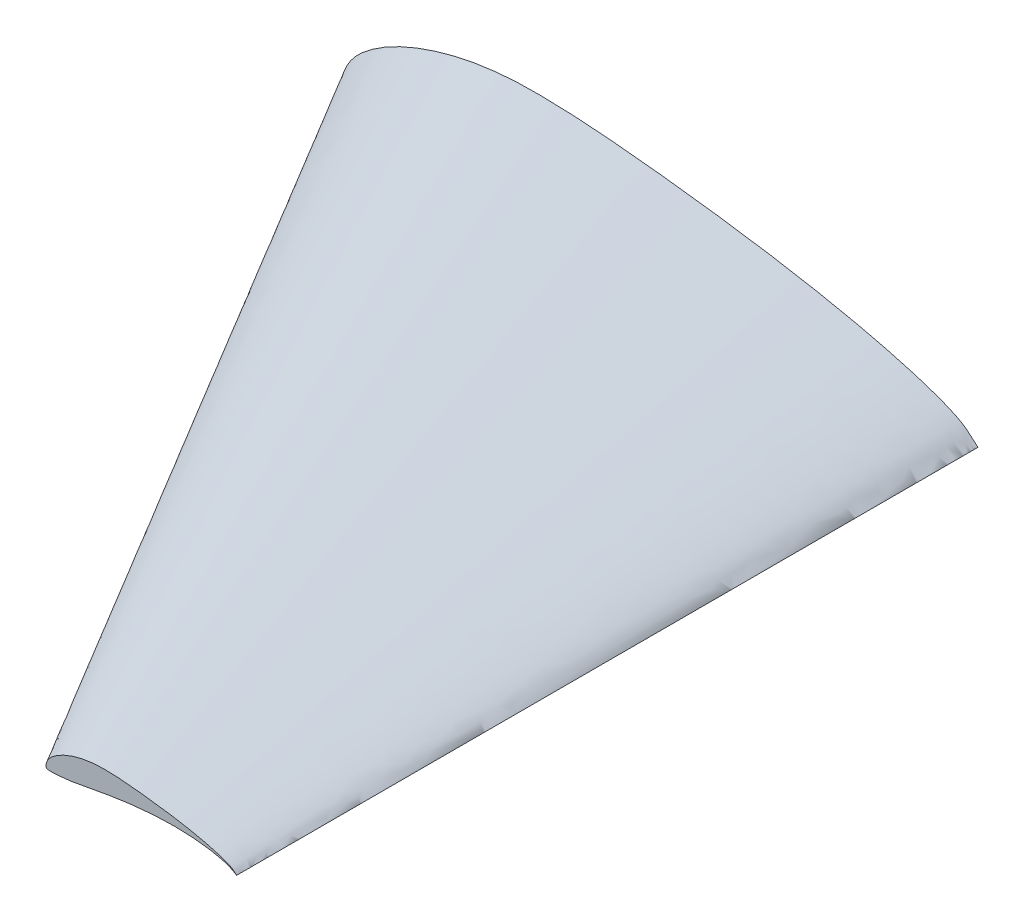
ISO-10303-21;
HEADER;
FILE_DESCRIPTION(('STEP AP214'),'2;1');
FILE_NAME('part.step','',(''),(''),'','','');
FILE_SCHEMA(('AUTOMOTIVE_DESIGN { 1 0 10303 214 1 1 1 1 }'));
ENDSEC;
DATA;
#1=APPLICATION_CONTEXT('core data for automotive mechanical design processes');
#2=APPLICATION_PROTOCOL_DEFINITION('international standard','automotive_design',2000,#1);
#3=PRODUCT_CONTEXT('',#1,'mechanical');
#4=PRODUCT('Part','Part','',(#3));
#5=PRODUCT_RELATED_PRODUCT_CATEGORY('part','',(#4));
#6=PRODUCT_DEFINITION_FORMATION('','',#4);
#7=PRODUCT_DEFINITION_CONTEXT('part definition',#1,'design');
#8=PRODUCT_DEFINITION('design','',#6,#7);
#9=PRODUCT_DEFINITION_SHAPE('','',#8);
#10=(LENGTH_UNIT() NAMED_UNIT(*) SI_UNIT(.MILLI.,.METRE.));
#11=(NAMED_UNIT(*) PLANE_ANGLE_UNIT() SI_UNIT($,.RADIAN.));
#12=(NAMED_UNIT(*) SI_UNIT($,.STERADIAN.) SOLID_ANGLE_UNIT());
#13=UNCERTAINTY_MEASURE_WITH_UNIT(LENGTH_MEASURE(1.E-05),#10,'distance_accuracy_value','');
#14=(GEOMETRIC_REPRESENTATION_CONTEXT(3) GLOBAL_UNCERTAINTY_ASSIGNED_CONTEXT((#13)) GLOBAL_UNIT_ASSIGNED_CONTEXT((#10,
#11,#12)) REPRESENTATION_CONTEXT('',''));
#15=CARTESIAN_POINT('',(0.,0.,0.));
#16=DIRECTION('',(0.,0.,1.));
#17=DIRECTION('',(1.,0.,0.));
#18=AXIS2_PLACEMENT_3D('',#15,#16,#17);
#19=CARTESIAN_POINT('',(0.358648893938825,1.31203835702179,0.));
#20=DIRECTION('',(0.,0.,-1.));
#21=DIRECTION('',(-1.,0.,0.));
#22=AXIS2_PLACEMENT_3D('',#19,#20,#21);
#23=PLANE('',#22);
#24=CARTESIAN_POINT('',(40.02,5.,0.));
#25=DIRECTION('',(0.,0.,-1.));
#26=DIRECTION('',(-1.,0.,0.));
#27=AXIS2_PLACEMENT_3D('',#24,#25,#26);
#28=CIRCLE('',#27,0.750000000000008);
#29=CARTESIAN_POINT('',(40.02,5.75000000000001,0.));
#30=VERTEX_POINT('',#29);
#31=CARTESIAN_POINT('',(40.02,4.24999999999999,0.));
#32=VERTEX_POINT('',#31);
#33=EDGE_CURVE('E86',#30,#32,#28,.T.);
#34=ORIENTED_EDGE('',*,*,#33,.F.);
#35=DIRECTION('',(-1.,0.,0.));
#36=VECTOR('',#35,1.);
#37=CARTESIAN_POINT('',(40.02,5.75000000000001,0.));
#38=LINE('',#37,#36);
#39=CARTESIAN_POINT('',(27.02,5.75,0.));
#40=VERTEX_POINT('',#39);
#41=EDGE_CURVE('E167',#30,#40,#38,.T.);
#42=ORIENTED_EDGE('',*,*,#41,.T.);
#43=CARTESIAN_POINT('',(27.02,5.,0.));
#44=DIRECTION('',(0.,0.,-1.));
#45=DIRECTION('',(-1.,0.,0.));
#46=AXIS2_PLACEMENT_3D('',#43,#44,#45);
#47=CIRCLE('',#46,0.749999999999999);
#48=CARTESIAN_POINT('',(27.02,4.25,0.));
#49=VERTEX_POINT('',#48);
#50=EDGE_CURVE('E180',#49,#40,#47,.T.);
#51=ORIENTED_EDGE('',*,*,#50,.F.);
#52=DIRECTION('',(-1.,0.,0.));
#53=VECTOR('',#52,1.);
#54=CARTESIAN_POINT('',(40.02,4.24999999999999,0.));
#55=LINE('',#54,#53);
#56=EDGE_CURVE('E177',#32,#49,#55,.T.);
#57=ORIENTED_EDGE('',*,*,#56,.F.);
#58=EDGE_LOOP('',(#34,#42,#51,#57));
#59=FACE_BOUND('',#58,.T.);
#60=CARTESIAN_POINT('',(23.51,5.,0.));
#61=DIRECTION('',(0.,0.,-1.));
#62=DIRECTION('',(-1.,0.,0.));
#63=AXIS2_PLACEMENT_3D('',#60,#61,#62);
#64=CIRCLE('',#63,2.);
#65=CARTESIAN_POINT('',(21.51,5.,0.));
#66=VERTEX_POINT('',#65);
#67=EDGE_CURVE('E187',#66,#66,#64,.T.);
#68=ORIENTED_EDGE('',*,*,#67,.F.);
#69=EDGE_LOOP('',(#68));
#70=FACE_BOUND('',#69,.T.);
#71=CARTESIAN_POINT('',(60.,0.,0.));
#72=CARTESIAN_POINT('',(60.0003591967076,0.00152743166866113,0.));
#73=CARTESIAN_POINT('',(59.8031171503171,0.148486190866981,0.));
#74=CARTESIAN_POINT('',(59.6363051275394,0.312157693204799,0.));
#75=CARTESIAN_POINT('',(59.265915035483,0.654017791026096,0.));
#76=CARTESIAN_POINT('',(58.828941407944,1.01769187040323,0.));
#77=CARTESIAN_POINT('',(58.2311986071286,1.38431433802317,0.));
#78=CARTESIAN_POINT('',(57.4879028587413,1.73962008144949,0.));
#79=CARTESIAN_POINT('',(56.5905605509476,2.11038996867272,0.));
#80=CARTESIAN_POINT('',(55.5405906841004,2.49165505155028,0.));
#81=CARTESIAN_POINT('',(54.3426606505066,2.87984653664435,0.));
#82=CARTESIAN_POINT('',(53.0044503542957,3.27530791932623,0.));
#83=CARTESIAN_POINT('',(51.5282398733248,3.65993308110928,0.));
#84=CARTESIAN_POINT('',(49.9318628263046,4.06561454332629,0.));
#85=CARTESIAN_POINT('',(48.2145350695117,4.45252726033602,0.));
#86=CARTESIAN_POINT('',(46.3922162813386,4.8372114388325,0.));
#87=CARTESIAN_POINT('',(44.4741846373565,5.21215240354569,0.));
#88=CARTESIAN_POINT('',(42.4720640696188,5.57436949248205,0.));
#89=CARTESIAN_POINT('',(40.3983436281798,5.92287598001367,0.));
#90=CARTESIAN_POINT('',(38.2650079778576,6.25331693697473,0.));
#91=CARTESIAN_POINT('',(36.0858440170008,6.56630027476171,0.));
#92=CARTESIAN_POINT('',(33.8748202071201,6.85935611065016,0.));
#93=CARTESIAN_POINT('',(31.6479502828675,7.13154383170439,0.));
#94=CARTESIAN_POINT('',(29.4230365764783,7.38479145195094,0.));
#95=CARTESIAN_POINT('',(27.2184980068069,7.61270867154978,0.));
#96=CARTESIAN_POINT('',(25.052294626095,7.81102981614016,0.));
#97=CARTESIAN_POINT('',(22.9396617347882,7.96859227406435,0.));
#98=CARTESIAN_POINT('',(20.8926674686435,8.07697502334032,0.));
#99=CARTESIAN_POINT('',(18.9226999256131,8.12377974427893,0.));
#100=CARTESIAN_POINT('',(17.0398509693804,8.11879768752978,0.));
#101=CARTESIAN_POINT('',(15.2476328415943,8.02660789751006,0.));
#102=CARTESIAN_POINT('',(13.5453512859509,7.839789441016,0.));
#103=CARTESIAN_POINT('',(11.926076695069,7.57562537309296,0.));
#104=CARTESIAN_POINT('',(10.3894182556015,7.23340315512576,0.));
#105=CARTESIAN_POINT('',(8.93695465998708,6.83209986705336,0.));
#106=CARTESIAN_POINT('',(7.57483146116029,6.37882320453374,0.));
#107=CARTESIAN_POINT('',(6.30884164347269,5.88417305863267,0.));
#108=CARTESIAN_POINT('',(5.14685221592727,5.35079958311253,0.));
#109=CARTESIAN_POINT('',(4.09258962341009,4.78953179393415,0.));
#110=CARTESIAN_POINT('',(3.15178940082182,4.20675239007223,0.));
#111=CARTESIAN_POINT('',(2.33035140361199,3.61035853790743,0.));
#112=CARTESIAN_POINT('',(1.62861455630535,3.01299152689761,0.));
#113=CARTESIAN_POINT('',(1.05675527613261,2.40813064719845,0.));
#114=CARTESIAN_POINT('',(0.617494407148315,1.80101400701995,0.));
#115=CARTESIAN_POINT('',(0.2930234664486,1.21037036917539,0.));
#116=CARTESIAN_POINT('',(0.0850719316488285,0.649582218808172,0.));
#117=CARTESIAN_POINT('',(-0.0140169847637187,0.131974925650224,0.));
#118=CARTESIAN_POINT('',(0.0051098577528765,-0.305798157678561,0.));
#119=CARTESIAN_POINT('',(0.117816244960925,-0.707306615975616,0.));
#120=CARTESIAN_POINT('',(0.536763933386814,-0.90661835605631,0.));
#121=CARTESIAN_POINT('',(1.10004460153965,-0.934581165480218,0.));
#122=CARTESIAN_POINT('',(1.8706104555078,-0.961682830343907,0.));
#123=CARTESIAN_POINT('',(2.8396514000118,-0.919895750020732,0.));
#124=CARTESIAN_POINT('',(3.99621535818404,-0.843103830870702,0.));
#125=CARTESIAN_POINT('',(5.3274309804443,-0.720099828376295,0.));
#126=CARTESIAN_POINT('',(6.81967624191513,-0.553670124333049,0.));
#127=CARTESIAN_POINT('',(8.46567456259763,-0.340243437522128,0.));
#128=CARTESIAN_POINT('',(10.2646215673956,-0.0419478858174395,0.));
#129=CARTESIAN_POINT('',(12.2252761749415,0.332109900745339,0.));
#130=CARTESIAN_POINT('',(14.3574403385057,0.739204137605637,0.));
#131=CARTESIAN_POINT('',(16.650692213626,1.16903728804964,0.));
#132=CARTESIAN_POINT('',(19.0906277666481,1.60376835003282,0.));
#133=CARTESIAN_POINT('',(21.6593280235428,2.02708237663987,0.));
#134=CARTESIAN_POINT('',(24.3368648292331,2.42484380478589,0.));
#135=CARTESIAN_POINT('',(27.1001632949703,2.78246131453942,0.));
#136=CARTESIAN_POINT('',(29.9243738514525,3.08952194695553,0.));
#137=CARTESIAN_POINT('',(32.7828181702501,3.33224073356768,0.));
#138=CARTESIAN_POINT('',(35.6468110581785,3.5042984247576,0.));
#139=CARTESIAN_POINT('',(38.4864311413307,3.59888806789702,0.));
#140=CARTESIAN_POINT('',(41.270873524825,3.61083541756505,0.));
#141=CARTESIAN_POINT('',(43.9690733929395,3.53932870712883,0.));
#142=CARTESIAN_POINT('',(46.5501347587453,3.38604192261378,0.));
#143=CARTESIAN_POINT('',(48.9830207247781,3.15295287632235,0.));
#144=CARTESIAN_POINT('',(51.2387663269364,2.84900866508274,0.));
#145=CARTESIAN_POINT('',(53.2880024798237,2.48302860424677,0.));
#146=CARTESIAN_POINT('',(55.1067027969541,2.06726981959666,0.));
#147=CARTESIAN_POINT('',(56.6613494668884,1.62238939798338,0.));
#148=CARTESIAN_POINT('',(57.9336674364374,1.14757460538814,0.));
#149=CARTESIAN_POINT('',(58.8414335563824,0.71305828177372,0.));
#150=CARTESIAN_POINT('',(59.510705283188,0.311289893981384,0.));
#151=CARTESIAN_POINT('',(59.7678107009083,0.155812155482037,0.));
#152=CARTESIAN_POINT('',(59.9996335008558,-0.00155848421639207,0.));
#153=CARTESIAN_POINT('',(60.,0.,0.));
#154=B_SPLINE_CURVE_WITH_KNOTS('',3,(#71,#72,#73,#74,#75,#76,#77,#78,#79,#80,#81,#82,#83,#84,
#85,#86,#87,#88,#89,#90,#91,#92,#93,#94,#95,#96,#97,#98,#99,#100,#101,#102,#103,#104,#105,#106,
#107,#108,#109,#110,#111,#112,#113,#114,#115,#116,#117,#118,#119,#120,#121,#122,#123,#124,#125,
#126,#127,#128,#129,#130,#131,#132,#133,#134,#135,#136,#137,#138,#139,#140,#141,#142,#143,#144,
#145,#146,#147,#148,#149,#150,#151,#152,#153),.UNSPECIFIED.,.T.,.F.,(4,1,1,1,1,1,1,1,1,1,1,1,1,
1,1,1,1,1,1,1,1,1,1,1,1,1,1,1,1,1,1,1,1,1,1,1,1,1,1,1,1,1,1,1,1,1,1,1,1,1,1,1,1,1,1,1,1,1,1,1,1,
1,1,1,1,1,1,1,1,1,1,1,1,1,1,1,1,1,1,1,4),(0.,0.000979678264274593,0.00364886480154598,
0.0074835039211375,0.0120952859160778,0.0175256034270145,0.0240517973546713,0.0317830734940624,
0.0406778574448995,0.0507103373936484,0.0618332736939838,0.0739782064365048,0.0871175142640213,
0.101144399967861,0.115989999025582,0.131569794799979,0.147787764168625,0.164550313847436,
0.18175730453571,0.199311377000208,0.217094506604148,0.234989676272761,0.252856343827104,
0.270540067198934,0.287886265256047,0.304772935778624,0.321100929178702,0.336805584475211,
0.351799564707225,0.36603060578736,0.379615227120614,0.392652524490402,0.405169929353884,
0.417171498359163,0.428603104471847,0.439418554475609,0.449596188777818,0.459101688677971,
0.467907493465564,0.475987922499971,0.48330859579372,0.48987413960304,0.495802885785267,
0.501149051620522,0.505902716612247,0.510046414883828,0.513578959578029,0.51644657759361,
0.519349705653263,0.52382301147072,0.529973454728372,0.537715320706753,0.54696751748529,
0.557637047524215,0.569620170444662,0.582803823079722,0.597246670080713,0.613134757411944,
0.630443333580543,0.649055870293966,0.668822017748496,0.68959473994942,0.711189442398585,
0.733426496549274,0.756093941450603,0.778988394156727,0.80188953968707,0.824566471200233,
0.846792174293647,0.868338195473131,0.888978082822463,0.908491945289234,0.926658714643544,
0.943286152105764,0.958169180164938,0.971135800800317,0.981955610055375,0.990251783989627,
0.995852562256305,0.999000404965184,1.),.UNSPECIFIED.);
#155=CARTESIAN_POINT('',(60.,0.,0.));
#156=VERTEX_POINT('',#155);
#157=EDGE_CURVE('E14',#156,#156,#154,.T.);
#158=ORIENTED_EDGE('',*,*,#157,.F.);
#159=EDGE_LOOP('',(#158));
#160=FACE_BOUND('',#159,.T.);
#161=DIRECTION('',(1.,0.,0.));
#162=VECTOR('',#161,1.);
#163=CARTESIAN_POINT('',(7.,5.75000000000001,0.));
#164=LINE('',#163,#162);
#165=CARTESIAN_POINT('',(7.,5.75000000000001,0.));
#166=VERTEX_POINT('',#165);
#167=CARTESIAN_POINT('',(20.,5.75,0.));
#168=VERTEX_POINT('',#167);
#169=EDGE_CURVE('E145',#166,#168,#164,.T.);
#170=ORIENTED_EDGE('',*,*,#169,.F.);
#171=CARTESIAN_POINT('',(7.,5.,0.));
#172=DIRECTION('',(0.,0.,1.));
#173=DIRECTION('',(1.,0.,0.));
#174=AXIS2_PLACEMENT_3D('',#171,#172,#173);
#175=CIRCLE('',#174,0.750000000000008);
#176=CARTESIAN_POINT('',(7.,4.24999999999999,0.));
#177=VERTEX_POINT('',#176);
#178=EDGE_CURVE('E78',#166,#177,#175,.T.);
#179=ORIENTED_EDGE('',*,*,#178,.T.);
#180=DIRECTION('',(1.,0.,0.));
#181=VECTOR('',#180,1.);
#182=CARTESIAN_POINT('',(7.,4.24999999999999,0.));
#183=LINE('',#182,#181);
#184=CARTESIAN_POINT('',(20.,4.25,0.));
#185=VERTEX_POINT('',#184);
#186=EDGE_CURVE('E150',#177,#185,#183,.T.);
#187=ORIENTED_EDGE('',*,*,#186,.T.);
#188=CARTESIAN_POINT('',(20.,5.,0.));
#189=DIRECTION('',(0.,0.,1.));
#190=DIRECTION('',(1.,0.,0.));
#191=AXIS2_PLACEMENT_3D('',#188,#189,#190);
#192=CIRCLE('',#191,0.749999999999999);
#193=EDGE_CURVE('E134',#185,#168,#192,.T.);
#194=ORIENTED_EDGE('',*,*,#193,.T.);
#195=EDGE_LOOP('',(#170,#179,#187,#194));
#196=FACE_BOUND('',#195,.T.);
#197=ADVANCED_FACE('F60',(#59,#70,#160,#196),#23,.T.);
#198=CARTESIAN_POINT('',(42.1075946681816,0.393611507106538,70.));
#199=DIRECTION('',(0.,0.,-1.));
#200=DIRECTION('',(-1.,0.,0.));
#201=AXIS2_PLACEMENT_3D('',#198,#199,#200);
#202=PLANE('',#201);
#203=CARTESIAN_POINT('',(60.,0.,70.));
#204=CARTESIAN_POINT('',(60.0001077590123,0.00045822950059834,70.));
#205=CARTESIAN_POINT('',(59.9409351450951,0.0445458572600942,70.));
#206=CARTESIAN_POINT('',(59.8908915382618,0.0936473079614398,70.));
#207=CARTESIAN_POINT('',(59.7797745106449,0.196205337307829,70.));
#208=CARTESIAN_POINT('',(59.6486824223832,0.305307561120969,70.));
#209=CARTESIAN_POINT('',(59.4693595821386,0.415294301406952,70.));
#210=CARTESIAN_POINT('',(59.2463708576224,0.521886024434847,70.));
#211=CARTESIAN_POINT('',(58.9771681652843,0.633116990601815,70.));
#212=CARTESIAN_POINT('',(58.6621772052301,0.747496515465083,70.));
#213=CARTESIAN_POINT('',(58.302798195152,0.863953960993304,70.));
#214=CARTESIAN_POINT('',(57.9013351062887,0.982592375797868,70.));
#215=CARTESIAN_POINT('',(57.4584719619975,1.09797992433278,70.));
#216=CARTESIAN_POINT('',(56.9795588478914,1.21968436299789,70.));
#217=CARTESIAN_POINT('',(56.4643605208535,1.33575817810081,70.));
#218=CARTESIAN_POINT('',(55.9176648844016,1.45116343164975,70.));
#219=CARTESIAN_POINT('',(55.3422553912069,1.56364572106371,70.));
#220=CARTESIAN_POINT('',(54.7416192208856,1.67231084774462,70.));
#221=CARTESIAN_POINT('',(54.119503088454,1.7768627940041,70.));
#222=CARTESIAN_POINT('',(53.4795023933573,1.87599508109242,70.));
#223=CARTESIAN_POINT('',(52.8257532051002,1.96989008242851,70.));
#224=CARTESIAN_POINT('',(52.162446062136,2.05780683319505,70.));
#225=CARTESIAN_POINT('',(51.4943850848603,2.13946314951132,70.));
#226=CARTESIAN_POINT('',(50.8269109729435,2.21543743558528,70.));
#227=CARTESIAN_POINT('',(50.1655494020421,2.28381260146493,70.));
#228=CARTESIAN_POINT('',(49.5156883878285,2.34330894484205,70.));
#229=CARTESIAN_POINT('',(48.8818985204364,2.39057768221931,70.));
#230=CARTESIAN_POINT('',(48.2678002405931,2.42309250700209,70.));
#231=CARTESIAN_POINT('',(47.6768099776839,2.43713392328368,70.));
#232=CARTESIAN_POINT('',(47.1119552908141,2.43563930625894,70.));
#233=CARTESIAN_POINT('',(46.5742898524783,2.40798236925302,70.));
#234=CARTESIAN_POINT('',(46.0636053857853,2.3519368323048,70.));
#235=CARTESIAN_POINT('',(45.5778230085207,2.27268761192789,70.));
#236=CARTESIAN_POINT('',(45.1168254766805,2.17002094653773,70.));
#237=CARTESIAN_POINT('',(44.6810863979961,2.04962996011601,70.));
#238=CARTESIAN_POINT('',(44.2724494383481,1.91364696136012,70.));
#239=CARTESIAN_POINT('',(43.8926524930418,1.7652519175898,70.));
#240=CARTESIAN_POINT('',(43.5440556647782,1.60523987493376,70.));
#241=CARTESIAN_POINT('',(43.227776887023,1.43685953818025,70.));
#242=CARTESIAN_POINT('',(42.9455368202465,1.26202571702167,70.));
#243=CARTESIAN_POINT('',(42.6991054210836,1.08310756137223,70.));
#244=CARTESIAN_POINT('',(42.4885843668916,0.903897458069282,70.));
#245=CARTESIAN_POINT('',(42.3170265828398,0.722439194159534,70.));
#246=CARTESIAN_POINT('',(42.1852483221445,0.540304202105985,70.));
#247=CARTESIAN_POINT('',(42.0879070399346,0.363111110752618,70.));
#248=CARTESIAN_POINT('',(42.0255215794946,0.194874665642452,70.));
#249=CARTESIAN_POINT('',(41.9957949045709,0.0395924776950672,70.));
#250=CARTESIAN_POINT('',(42.0015329573259,-0.0917394473035684,70.));
#251=CARTESIAN_POINT('',(42.0353448734883,-0.212191984792685,70.));
#252=CARTESIAN_POINT('',(42.161029180016,-0.271985506816893,70.));
#253=CARTESIAN_POINT('',(42.3300133804619,-0.280374349644065,70.));
#254=CARTESIAN_POINT('',(42.5611831366523,-0.288504849103172,70.));
#255=CARTESIAN_POINT('',(42.8518954200035,-0.27596872500622,70.));
#256=CARTESIAN_POINT('',(43.1988646074552,-0.252931149261211,70.));
#257=CARTESIAN_POINT('',(43.5982292941333,-0.216029948512889,70.));
#258=CARTESIAN_POINT('',(44.0459028725745,-0.166101037299915,70.));
#259=CARTESIAN_POINT('',(44.5397023687793,-0.102073031256638,70.));
#260=CARTESIAN_POINT('',(45.0793864702187,-0.0125843657452318,70.));
#261=CARTESIAN_POINT('',(45.6675828524825,0.0996329702236017,70.));
#262=CARTESIAN_POINT('',(46.3072321015517,0.221761241281691,70.));
#263=CARTESIAN_POINT('',(46.9952076640878,0.350711186414893,70.));
#264=CARTESIAN_POINT('',(47.7271883299944,0.481130505009847,70.));
#265=CARTESIAN_POINT('',(48.4977984070628,0.608124712991961,70.));
#266=CARTESIAN_POINT('',(49.3010594487699,0.727453141435768,70.));
#267=CARTESIAN_POINT('',(50.1300489884911,0.834738394361826,70.));
#268=CARTESIAN_POINT('',(50.9773121554357,0.926856584086659,70.));
#269=CARTESIAN_POINT('',(51.834845451075,0.999672220070305,70.));
#270=CARTESIAN_POINT('',(52.6940433174535,1.05128952742728,70.));
#271=CARTESIAN_POINT('',(53.5459293423992,1.07966642036911,70.));
#272=CARTESIAN_POINT('',(54.3812620574475,1.08325062526952,70.));
#273=CARTESIAN_POINT('',(55.1907220178818,1.06179861213865,70.));
#274=CARTESIAN_POINT('',(55.9650404276236,1.01581257678414,70.));
#275=CARTESIAN_POINT('',(56.6949062174334,0.945885862896706,70.));
#276=CARTESIAN_POINT('',(57.3716298980809,0.854702599524822,70.));
#277=CARTESIAN_POINT('',(57.9864007439471,0.744908581274031,70.));
#278=CARTESIAN_POINT('',(58.5320108390862,0.620180945878999,70.));
#279=CARTESIAN_POINT('',(58.9984048400665,0.486716819395014,70.));
#280=CARTESIAN_POINT('',(59.3801002309312,0.344272381616441,70.));
#281=CARTESIAN_POINT('',(59.6524300669147,0.213917484532116,70.));
#282=CARTESIAN_POINT('',(59.8532115849564,0.0933869681944152,70.));
#283=CARTESIAN_POINT('',(59.9303432102725,0.0467436466446112,70.));
#284=CARTESIAN_POINT('',(59.9998900502568,-0.000467545264917618,70.));
#285=CARTESIAN_POINT('',(60.,0.,70.));
#286=B_SPLINE_CURVE_WITH_KNOTS('',3,(#203,#204,#205,#206,#207,#208,#209,#210,#211,#212,#213,
#214,#215,#216,#217,#218,#219,#220,#221,#222,#223,#224,#225,#226,#227,#228,#229,#230,#231,#232,
#233,#234,#235,#236,#237,#238,#239,#240,#241,#242,#243,#244,#245,#246,#247,#248,#249,#250,#251,
#252,#253,#254,#255,#256,#257,#258,#259,#260,#261,#262,#263,#264,#265,#266,#267,#268,#269,#270,
#271,#272,#273,#274,#275,#276,#277,#278,#279,#280,#281,#282,#283,#284,#285),.UNSPECIFIED.,.T.,
.F.,(4,1,1,1,1,1,1,1,1,1,1,1,1,1,1,1,1,1,1,1,1,1,1,1,1,1,1,1,1,1,1,1,1,1,1,1,1,1,1,1,1,1,1,1,1,
1,1,1,1,1,1,1,1,1,1,1,1,1,1,1,1,1,1,1,1,1,1,1,1,1,1,1,1,1,1,1,1,1,1,1,4),(0.,
0.000979678264274593,0.00364886480154598,0.0074835039211375,0.0120952859160778,
0.0175256034270145,0.0240517973546713,0.0317830734940624,0.0406778574448995,0.0507103373936484,
0.0618332736939838,0.0739782064365048,0.0871175142640213,0.101144399967861,0.115989999025582,
0.131569794799979,0.147787764168625,0.164550313847436,0.18175730453571,0.199311377000208,
0.217094506604148,0.234989676272761,0.252856343827104,0.270540067198934,0.287886265256047,
0.304772935778624,0.321100929178702,0.336805584475211,0.351799564707225,0.36603060578736,
0.379615227120614,0.392652524490402,0.405169929353884,0.417171498359163,0.428603104471847,
0.439418554475609,0.449596188777818,0.459101688677971,0.467907493465564,0.475987922499971,
0.48330859579372,0.48987413960304,0.495802885785267,0.501149051620522,0.505902716612247,
0.510046414883828,0.513578959578029,0.51644657759361,0.519349705653263,0.52382301147072,
0.529973454728372,0.537715320706753,0.54696751748529,0.557637047524215,0.569620170444662,
0.582803823079722,0.597246670080713,0.613134757411944,0.630443333580543,0.649055870293966,
0.668822017748496,0.68959473994942,0.711189442398585,0.733426496549274,0.756093941450603,
0.778988394156727,0.80188953968707,0.824566471200233,0.846792174293647,0.868338195473131,
0.888978082822463,0.908491945289234,0.926658714643544,0.943286152105764,0.958169180164938,
0.971135800800317,0.981955610055375,0.990251783989627,0.995852562256305,0.999000404965184,1.),.UNSPECIFIED.);
#287=CARTESIAN_POINT('',(60.,0.,70.));
#288=VERTEX_POINT('',#287);
#289=EDGE_CURVE('E70',#288,#288,#286,.T.);
#290=ORIENTED_EDGE('',*,*,#289,.T.);
#291=EDGE_LOOP('',(#290));
#292=FACE_BOUND('',#291,.T.);
#293=ADVANCED_FACE('F218',(#292),#202,.F.);
#294=CARTESIAN_POINT('',(60.,0.,70.));
#295=CARTESIAN_POINT('',(60.,0.,0.));
#296=CARTESIAN_POINT('',(59.9998900502568,-0.000467545264917618,70.));
#297=CARTESIAN_POINT('',(59.9996335008558,-0.00155848421639207,0.));
#298=CARTESIAN_POINT('',(59.9303432102725,0.0467436466446112,70.));
#299=CARTESIAN_POINT('',(59.7678107009083,0.155812155482037,0.));
#300=CARTESIAN_POINT('',(59.8532115849564,0.0933869681944152,70.));
#301=CARTESIAN_POINT('',(59.510705283188,0.311289893981384,0.));
#302=CARTESIAN_POINT('',(59.6524300669147,0.213917484532116,70.));
#303=CARTESIAN_POINT('',(58.8414335563824,0.71305828177372,0.));
#304=CARTESIAN_POINT('',(59.3801002309312,0.344272381616441,70.));
#305=CARTESIAN_POINT('',(57.9336674364374,1.14757460538814,0.));
#306=CARTESIAN_POINT('',(58.9984048400665,0.486716819395014,70.));
#307=CARTESIAN_POINT('',(56.6613494668884,1.62238939798338,0.));
#308=CARTESIAN_POINT('',(58.5320108390862,0.620180945878999,70.));
#309=CARTESIAN_POINT('',(55.1067027969541,2.06726981959666,0.));
#310=CARTESIAN_POINT('',(57.9864007439471,0.744908581274031,70.));
#311=CARTESIAN_POINT('',(53.2880024798237,2.48302860424677,0.));
#312=CARTESIAN_POINT('',(57.3716298980809,0.854702599524822,70.));
#313=CARTESIAN_POINT('',(51.2387663269364,2.84900866508274,0.));
#314=CARTESIAN_POINT('',(56.6949062174334,0.945885862896706,70.));
#315=CARTESIAN_POINT('',(48.9830207247781,3.15295287632235,0.));
#316=CARTESIAN_POINT('',(55.9650404276236,1.01581257678414,70.));
#317=CARTESIAN_POINT('',(46.5501347587453,3.38604192261378,0.));
#318=CARTESIAN_POINT('',(55.1907220178818,1.06179861213865,70.));
#319=CARTESIAN_POINT('',(43.9690733929395,3.53932870712883,0.));
#320=CARTESIAN_POINT('',(54.3812620574475,1.08325062526952,70.));
#321=CARTESIAN_POINT('',(41.270873524825,3.61083541756505,0.));
#322=CARTESIAN_POINT('',(53.5459293423992,1.07966642036911,70.));
#323=CARTESIAN_POINT('',(38.4864311413307,3.59888806789702,0.));
#324=CARTESIAN_POINT('',(52.6940433174535,1.05128952742728,70.));
#325=CARTESIAN_POINT('',(35.6468110581785,3.5042984247576,0.));
#326=CARTESIAN_POINT('',(51.834845451075,0.999672220070305,70.));
#327=CARTESIAN_POINT('',(32.7828181702501,3.33224073356768,0.));
#328=CARTESIAN_POINT('',(50.9773121554357,0.926856584086659,70.));
#329=CARTESIAN_POINT('',(29.9243738514525,3.08952194695553,0.));
#330=CARTESIAN_POINT('',(50.1300489884911,0.834738394361826,70.));
#331=CARTESIAN_POINT('',(27.1001632949703,2.78246131453942,0.));
#332=CARTESIAN_POINT('',(49.3010594487699,0.727453141435768,70.));
#333=CARTESIAN_POINT('',(24.3368648292331,2.42484380478589,0.));
#334=CARTESIAN_POINT('',(48.4977984070628,0.608124712991961,70.));
#335=CARTESIAN_POINT('',(21.6593280235428,2.02708237663987,0.));
#336=CARTESIAN_POINT('',(47.7271883299944,0.481130505009847,70.));
#337=CARTESIAN_POINT('',(19.0906277666481,1.60376835003282,0.));
#338=CARTESIAN_POINT('',(46.9952076640878,0.350711186414893,70.));
#339=CARTESIAN_POINT('',(16.650692213626,1.16903728804964,0.));
#340=CARTESIAN_POINT('',(46.3072321015517,0.221761241281691,70.));
#341=CARTESIAN_POINT('',(14.3574403385057,0.739204137605637,0.));
#342=CARTESIAN_POINT('',(45.6675828524825,0.0996329702236017,70.));
#343=CARTESIAN_POINT('',(12.2252761749415,0.332109900745339,0.));
#344=CARTESIAN_POINT('',(45.0793864702187,-0.0125843657452318,70.));
#345=CARTESIAN_POINT('',(10.2646215673956,-0.0419478858174395,0.));
#346=CARTESIAN_POINT('',(44.5397023687793,-0.102073031256638,70.));
#347=CARTESIAN_POINT('',(8.46567456259763,-0.340243437522128,0.));
#348=CARTESIAN_POINT('',(44.0459028725745,-0.166101037299915,70.));
#349=CARTESIAN_POINT('',(6.81967624191513,-0.553670124333049,0.));
#350=CARTESIAN_POINT('',(43.5982292941333,-0.216029948512889,70.));
#351=CARTESIAN_POINT('',(5.3274309804443,-0.720099828376295,0.));
#352=CARTESIAN_POINT('',(43.1988646074552,-0.252931149261211,70.));
#353=CARTESIAN_POINT('',(3.99621535818404,-0.843103830870702,0.));
#354=CARTESIAN_POINT('',(42.8518954200035,-0.27596872500622,70.));
#355=CARTESIAN_POINT('',(2.8396514000118,-0.919895750020732,0.));
#356=CARTESIAN_POINT('',(42.5611831366523,-0.288504849103172,70.));
#357=CARTESIAN_POINT('',(1.8706104555078,-0.961682830343907,0.));
#358=CARTESIAN_POINT('',(42.3300133804619,-0.280374349644065,70.));
#359=CARTESIAN_POINT('',(1.10004460153965,-0.934581165480218,0.));
#360=CARTESIAN_POINT('',(42.161029180016,-0.271985506816893,70.));
#361=CARTESIAN_POINT('',(0.536763933386814,-0.90661835605631,0.));
#362=CARTESIAN_POINT('',(42.0353448734883,-0.212191984792685,70.));
#363=CARTESIAN_POINT('',(0.117816244960925,-0.707306615975616,0.));
#364=CARTESIAN_POINT('',(42.0015329573259,-0.0917394473035684,70.));
#365=CARTESIAN_POINT('',(0.0051098577528765,-0.305798157678561,0.));
#366=CARTESIAN_POINT('',(41.9957949045709,0.0395924776950672,70.));
#367=CARTESIAN_POINT('',(-0.0140169847637187,0.131974925650224,0.));
#368=CARTESIAN_POINT('',(42.0255215794946,0.194874665642452,70.));
#369=CARTESIAN_POINT('',(0.0850719316488285,0.649582218808172,0.));
#370=CARTESIAN_POINT('',(42.0879070399346,0.363111110752618,70.));
#371=CARTESIAN_POINT('',(0.2930234664486,1.21037036917539,0.));
#372=CARTESIAN_POINT('',(42.1852483221445,0.540304202105985,70.));
#373=CARTESIAN_POINT('',(0.617494407148315,1.80101400701995,0.));
#374=CARTESIAN_POINT('',(42.3170265828398,0.722439194159534,70.));
#375=CARTESIAN_POINT('',(1.05675527613261,2.40813064719845,0.));
#376=CARTESIAN_POINT('',(42.4885843668916,0.903897458069282,70.));
#377=CARTESIAN_POINT('',(1.62861455630535,3.01299152689761,0.));
#378=CARTESIAN_POINT('',(42.6991054210836,1.08310756137223,70.));
#379=CARTESIAN_POINT('',(2.33035140361199,3.61035853790743,0.));
#380=CARTESIAN_POINT('',(42.9455368202465,1.26202571702167,70.));
#381=CARTESIAN_POINT('',(3.15178940082182,4.20675239007223,0.));
#382=CARTESIAN_POINT('',(43.227776887023,1.43685953818025,70.));
#383=CARTESIAN_POINT('',(4.09258962341009,4.78953179393415,0.));
#384=CARTESIAN_POINT('',(43.5440556647782,1.60523987493376,70.));
#385=CARTESIAN_POINT('',(5.14685221592727,5.35079958311253,0.));
#386=CARTESIAN_POINT('',(43.8926524930418,1.7652519175898,70.));
#387=CARTESIAN_POINT('',(6.30884164347269,5.88417305863267,0.));
#388=CARTESIAN_POINT('',(44.2724494383481,1.91364696136012,70.));
#389=CARTESIAN_POINT('',(7.57483146116029,6.37882320453374,0.));
#390=CARTESIAN_POINT('',(44.6810863979961,2.04962996011601,70.));
#391=CARTESIAN_POINT('',(8.93695465998708,6.83209986705336,0.));
#392=CARTESIAN_POINT('',(45.1168254766805,2.17002094653773,70.));
#393=CARTESIAN_POINT('',(10.3894182556015,7.23340315512576,0.));
#394=CARTESIAN_POINT('',(45.5778230085207,2.27268761192789,70.));
#395=CARTESIAN_POINT('',(11.926076695069,7.57562537309296,0.));
#396=CARTESIAN_POINT('',(46.0636053857853,2.3519368323048,70.));
#397=CARTESIAN_POINT('',(13.5453512859509,7.839789441016,0.));
#398=CARTESIAN_POINT('',(46.5742898524783,2.40798236925302,70.));
#399=CARTESIAN_POINT('',(15.2476328415943,8.02660789751006,0.));
#400=CARTESIAN_POINT('',(47.1119552908141,2.43563930625894,70.));
#401=CARTESIAN_POINT('',(17.0398509693804,8.11879768752978,0.));
#402=CARTESIAN_POINT('',(47.6768099776839,2.43713392328368,70.));
#403=CARTESIAN_POINT('',(18.9226999256131,8.12377974427893,0.));
#404=CARTESIAN_POINT('',(48.2678002405931,2.42309250700209,70.));
#405=CARTESIAN_POINT('',(20.8926674686435,8.07697502334032,0.));
#406=CARTESIAN_POINT('',(48.8818985204364,2.39057768221931,70.));
#407=CARTESIAN_POINT('',(22.9396617347882,7.96859227406435,0.));
#408=CARTESIAN_POINT('',(49.5156883878285,2.34330894484205,70.));
#409=CARTESIAN_POINT('',(25.052294626095,7.81102981614016,0.));
#410=CARTESIAN_POINT('',(50.1655494020421,2.28381260146493,70.));
#411=CARTESIAN_POINT('',(27.2184980068069,7.61270867154978,0.));
#412=CARTESIAN_POINT('',(50.8269109729435,2.21543743558528,70.));
#413=CARTESIAN_POINT('',(29.4230365764783,7.38479145195094,0.));
#414=CARTESIAN_POINT('',(51.4943850848603,2.13946314951132,70.));
#415=CARTESIAN_POINT('',(31.6479502828675,7.13154383170439,0.));
#416=CARTESIAN_POINT('',(52.162446062136,2.05780683319505,70.));
#417=CARTESIAN_POINT('',(33.8748202071201,6.85935611065016,0.));
#418=CARTESIAN_POINT('',(52.8257532051002,1.96989008242851,70.));
#419=CARTESIAN_POINT('',(36.0858440170008,6.56630027476171,0.));
#420=CARTESIAN_POINT('',(53.4795023933573,1.87599508109242,70.));
#421=CARTESIAN_POINT('',(38.2650079778576,6.25331693697473,0.));
#422=CARTESIAN_POINT('',(54.119503088454,1.7768627940041,70.));
#423=CARTESIAN_POINT('',(40.3983436281798,5.92287598001367,0.));
#424=CARTESIAN_POINT('',(54.7416192208856,1.67231084774462,70.));
#425=CARTESIAN_POINT('',(42.4720640696188,5.57436949248205,0.));
#426=CARTESIAN_POINT('',(55.3422553912069,1.56364572106371,70.));
#427=CARTESIAN_POINT('',(44.4741846373565,5.21215240354569,0.));
#428=CARTESIAN_POINT('',(55.9176648844016,1.45116343164975,70.));
#429=CARTESIAN_POINT('',(46.3922162813386,4.8372114388325,0.));
#430=CARTESIAN_POINT('',(56.4643605208535,1.33575817810081,70.));
#431=CARTESIAN_POINT('',(48.2145350695117,4.45252726033602,0.));
#432=CARTESIAN_POINT('',(56.9795588478914,1.21968436299789,70.));
#433=CARTESIAN_POINT('',(49.9318628263046,4.06561454332629,0.));
#434=CARTESIAN_POINT('',(57.4584719619975,1.09797992433278,70.));
#435=CARTESIAN_POINT('',(51.5282398733248,3.65993308110928,0.));
#436=CARTESIAN_POINT('',(57.9013351062887,0.982592375797868,70.));
#437=CARTESIAN_POINT('',(53.0044503542957,3.27530791932623,0.));
#438=CARTESIAN_POINT('',(58.302798195152,0.863953960993304,70.));
#439=CARTESIAN_POINT('',(54.3426606505066,2.87984653664435,0.));
#440=CARTESIAN_POINT('',(58.6621772052301,0.747496515465083,70.));
#441=CARTESIAN_POINT('',(55.5405906841004,2.49165505155028,0.));
#442=CARTESIAN_POINT('',(58.9771681652843,0.633116990601815,70.));
#443=CARTESIAN_POINT('',(56.5905605509476,2.11038996867272,0.));
#444=CARTESIAN_POINT('',(59.2463708576224,0.521886024434847,70.));
#445=CARTESIAN_POINT('',(57.4879028587413,1.73962008144949,0.));
#446=CARTESIAN_POINT('',(59.4693595821386,0.415294301406952,70.));
#447=CARTESIAN_POINT('',(58.2311986071286,1.38431433802317,0.));
#448=CARTESIAN_POINT('',(59.6486824223832,0.305307561120969,70.));
#449=CARTESIAN_POINT('',(58.828941407944,1.01769187040323,0.));
#450=CARTESIAN_POINT('',(59.7797745106449,0.196205337307829,70.));
#451=CARTESIAN_POINT('',(59.265915035483,0.654017791026096,0.));
#452=CARTESIAN_POINT('',(59.8908915382618,0.0936473079614398,70.));
#453=CARTESIAN_POINT('',(59.6363051275394,0.312157693204799,0.));
#454=CARTESIAN_POINT('',(59.9409351450951,0.0445458572600942,70.));
#455=CARTESIAN_POINT('',(59.8031171503171,0.148486190866981,0.));
#456=CARTESIAN_POINT('',(60.0001077590123,0.000458229500598223,70.));
#457=CARTESIAN_POINT('',(60.0003591967076,0.00152743166866073,0.));
#458=CARTESIAN_POINT('',(60.,0.,70.));
#459=CARTESIAN_POINT('',(60.,0.,0.));
#460=B_SPLINE_SURFACE_WITH_KNOTS('',3,1,((#294,#295),(#296,#297),(#298,#299),(#300,#301),(#302,
#303),(#304,#305),(#306,#307),(#308,#309),(#310,#311),(#312,#313),(#314,#315),(#316,#317),(#318,
#319),(#320,#321),(#322,#323),(#324,#325),(#326,#327),(#328,#329),(#330,#331),(#332,#333),(#334,
#335),(#336,#337),(#338,#339),(#340,#341),(#342,#343),(#344,#345),(#346,#347),(#348,#349),(#350,
#351),(#352,#353),(#354,#355),(#356,#357),(#358,#359),(#360,#361),(#362,#363),(#364,#365),(#366,
#367),(#368,#369),(#370,#371),(#372,#373),(#374,#375),(#376,#377),(#378,#379),(#380,#381),(#382,
#383),(#384,#385),(#386,#387),(#388,#389),(#390,#391),(#392,#393),(#394,#395),(#396,#397),(#398,
#399),(#400,#401),(#402,#403),(#404,#405),(#406,#407),(#408,#409),(#410,#411),(#412,#413),(#414,
#415),(#416,#417),(#418,#419),(#420,#421),(#422,#423),(#424,#425),(#426,#427),(#428,#429),(#430,
#431),(#432,#433),(#434,#435),(#436,#437),(#438,#439),(#440,#441),(#442,#443),(#444,#445),(#446,
#447),(#448,#449),(#450,#451),(#452,#453),(#454,#455),(#456,#457),(#458,#459)),.UNSPECIFIED.,
.T.,.F.,.F.,(4,1,1,1,1,1,1,1,1,1,1,1,1,1,1,1,1,1,1,1,1,1,1,1,1,1,1,1,1,1,1,1,1,1,1,1,1,1,1,1,1,
1,1,1,1,1,1,1,1,1,1,1,1,1,1,1,1,1,1,1,1,1,1,1,1,1,1,1,1,1,1,1,1,1,1,1,1,1,1,1,4),(2,2),(0.,
0.000999595034815837,0.00414743774369519,0.00974821601037268,0.0180443899446245,
0.0288641991996833,0.0418308198350615,0.0567138478942355,0.0733412853564563,0.0915080547107664,
0.111021917177537,0.131661804526869,0.153207825706353,0.175433528799767,0.19811046031293,
0.221011605843273,0.243906058549397,0.266573503450726,0.288810557601415,0.31040526005058,
0.331177982251504,0.350944129706034,0.369556666419457,0.386865242588056,0.402753329919287,
0.417196176920278,0.430379829555338,0.442362952475785,0.45303248251471,0.462284679293247,
0.470026545271628,0.47617698852928,0.480650294346737,0.48355342240639,0.486421040421971,
0.489953585116172,0.494097283387753,0.498850948379478,0.504197114214733,0.51012586039696,
0.51669140420628,0.524012077500029,0.532092506534436,0.540898311322029,0.550403811222182,
0.560581445524391,0.571396895528153,0.582828501640837,0.594830070646116,0.607347475509598,
0.620384772879386,0.63396939421264,0.648200435292775,0.663194415524789,0.678899070821298,
0.695227064221376,0.712113734743953,0.729459932801066,0.747143656172896,0.765010323727239,
0.782905493395852,0.800688622999792,0.81824269546429,0.835449686152564,0.852212235831375,
0.868430205200021,0.884010000974418,0.898855600032139,0.912882485735979,0.926021793563495,
0.938166726306016,0.949289662606352,0.959322142555101,0.968216926505938,0.975948202645329,
0.982474396572986,0.987904714083922,0.992516496078862,0.996351135198454,0.999020321735725,1.),
(0.,1.),.UNSPECIFIED.);
#461=ORIENTED_EDGE('',*,*,#289,.F.);
#462=EDGE_LOOP('',(#461));
#463=FACE_BOUND('',#462,.T.);
#464=ORIENTED_EDGE('',*,*,#157,.T.);
#465=EDGE_LOOP('',(#464));
#466=FACE_BOUND('',#465,.T.);
#467=ADVANCED_FACE('F206',(#463,#466),#460,.T.);
#468=CARTESIAN_POINT('',(23.51,5.,10.));
#469=DIRECTION('',(0.,0.,-1.));
#470=DIRECTION('',(-1.,0.,0.));
#471=AXIS2_PLACEMENT_3D('',#468,#469,#470);
#472=CYLINDRICAL_SURFACE('',#471,2.);
#473=CARTESIAN_POINT('',(23.51,5.,10.));
#474=DIRECTION('',(0.,0.,-1.));
#475=DIRECTION('',(-1.,0.,0.));
#476=AXIS2_PLACEMENT_3D('',#473,#474,#475);
#477=CIRCLE('',#476,2.);
#478=CARTESIAN_POINT('',(21.51,5.,10.));
#479=VERTEX_POINT('',#478);
#480=EDGE_CURVE('E193',#479,#479,#477,.T.);
#481=ORIENTED_EDGE('',*,*,#480,.F.);
#482=EDGE_LOOP('',(#481));
#483=FACE_BOUND('',#482,.T.);
#484=ORIENTED_EDGE('',*,*,#67,.T.);
#485=EDGE_LOOP('',(#484));
#486=FACE_BOUND('',#485,.T.);
#487=ADVANCED_FACE('F217',(#483,#486),#472,.F.);
#488=CARTESIAN_POINT('',(0.,0.,10.));
#489=DIRECTION('',(0.,0.,-1.));
#490=DIRECTION('',(-1.,0.,0.));
#491=AXIS2_PLACEMENT_3D('',#488,#489,#490);
#492=PLANE('',#491);
#493=ORIENTED_EDGE('',*,*,#480,.T.);
#494=EDGE_LOOP('',(#493));
#495=FACE_BOUND('',#494,.T.);
#496=ADVANCED_FACE('F272',(#495),#492,.T.);
#497=CARTESIAN_POINT('',(40.02,5.,1.));
#498=DIRECTION('',(0.,0.,-1.));
#499=DIRECTION('',(-1.,0.,0.));
#500=AXIS2_PLACEMENT_3D('',#497,#498,#499);
#501=CYLINDRICAL_SURFACE('',#500,0.750000000000008);
#502=ORIENTED_EDGE('',*,*,#33,.T.);
#503=DIRECTION('',(0.,0.,-1.));
#504=VECTOR('',#503,1.);
#505=CARTESIAN_POINT('',(40.02,4.24999999999999,1.));
#506=LINE('',#505,#504);
#507=CARTESIAN_POINT('',(40.02,4.24999999999999,1.));
#508=VERTEX_POINT('',#507);
#509=EDGE_CURVE('E175',#508,#32,#506,.T.);
#510=ORIENTED_EDGE('',*,*,#509,.F.);
#511=CARTESIAN_POINT('',(40.02,5.,1.));
#512=DIRECTION('',(0.,0.,-1.));
#513=DIRECTION('',(-1.,0.,0.));
#514=AXIS2_PLACEMENT_3D('',#511,#512,#513);
#515=CIRCLE('',#514,0.750000000000008);
#516=CARTESIAN_POINT('',(40.02,5.75000000000001,1.));
#517=VERTEX_POINT('',#516);
#518=EDGE_CURVE('E163',#517,#508,#515,.T.);
#519=ORIENTED_EDGE('',*,*,#518,.F.);
#520=DIRECTION('',(0.,0.,-1.));
#521=VECTOR('',#520,1.);
#522=CARTESIAN_POINT('',(40.02,5.75000000000001,1.));
#523=LINE('',#522,#521);
#524=EDGE_CURVE('E185',#517,#30,#523,.T.);
#525=ORIENTED_EDGE('',*,*,#524,.T.);
#526=EDGE_LOOP('',(#502,#510,#519,#525));
#527=FACE_BOUND('',#526,.T.);
#528=ADVANCED_FACE('F277',(#527),#501,.F.);
#529=CARTESIAN_POINT('',(40.02,5.75000000000001,1.));
#530=DIRECTION('',(0.,-1.,0.));
#531=DIRECTION('',(1.,0.,0.));
#532=AXIS2_PLACEMENT_3D('',#529,#530,#531);
#533=PLANE('',#532);
#534=ORIENTED_EDGE('',*,*,#41,.F.);
#535=ORIENTED_EDGE('',*,*,#524,.F.);
#536=DIRECTION('',(-1.,0.,0.));
#537=VECTOR('',#536,1.);
#538=CARTESIAN_POINT('',(40.02,5.75000000000001,1.));
#539=LINE('',#538,#537);
#540=CARTESIAN_POINT('',(27.02,5.75,1.));
#541=VERTEX_POINT('',#540);
#542=EDGE_CURVE('E173',#517,#541,#539,.T.);
#543=ORIENTED_EDGE('',*,*,#542,.T.);
#544=DIRECTION('',(0.,0.,-1.));
#545=VECTOR('',#544,1.);
#546=CARTESIAN_POINT('',(27.02,5.75,1.));
#547=LINE('',#546,#545);
#548=EDGE_CURVE('E188',#541,#40,#547,.T.);
#549=ORIENTED_EDGE('',*,*,#548,.T.);
#550=EDGE_LOOP('',(#534,#535,#543,#549));
#551=FACE_BOUND('',#550,.T.);
#552=ADVANCED_FACE('F284',(#551),#533,.T.);
#553=CARTESIAN_POINT('',(27.02,5.,1.));
#554=DIRECTION('',(0.,0.,-1.));
#555=DIRECTION('',(-1.,0.,0.));
#556=AXIS2_PLACEMENT_3D('',#553,#554,#555);
#557=CYLINDRICAL_SURFACE('',#556,0.749999999999999);
#558=ORIENTED_EDGE('',*,*,#50,.T.);
#559=ORIENTED_EDGE('',*,*,#548,.F.);
#560=CARTESIAN_POINT('',(27.02,5.,1.));
#561=DIRECTION('',(0.,0.,-1.));
#562=DIRECTION('',(-1.,0.,0.));
#563=AXIS2_PLACEMENT_3D('',#560,#561,#562);
#564=CIRCLE('',#563,0.749999999999999);
#565=CARTESIAN_POINT('',(27.02,4.25,1.));
#566=VERTEX_POINT('',#565);
#567=EDGE_CURVE('E170',#566,#541,#564,.T.);
#568=ORIENTED_EDGE('',*,*,#567,.F.);
#569=DIRECTION('',(0.,0.,-1.));
#570=VECTOR('',#569,1.);
#571=CARTESIAN_POINT('',(27.02,4.25,1.));
#572=LINE('',#571,#570);
#573=EDGE_CURVE('E190',#566,#49,#572,.T.);
#574=ORIENTED_EDGE('',*,*,#573,.T.);
#575=EDGE_LOOP('',(#558,#559,#568,#574));
#576=FACE_BOUND('',#575,.T.);
#577=ADVANCED_FACE('F289',(#576),#557,.F.);
#578=CARTESIAN_POINT('',(40.02,4.24999999999999,1.));
#579=DIRECTION('',(0.,-1.,0.));
#580=DIRECTION('',(1.,0.,0.));
#581=AXIS2_PLACEMENT_3D('',#578,#579,#580);
#582=PLANE('',#581);
#583=ORIENTED_EDGE('',*,*,#56,.T.);
#584=ORIENTED_EDGE('',*,*,#573,.F.);
#585=DIRECTION('',(-1.,0.,0.));
#586=VECTOR('',#585,1.);
#587=CARTESIAN_POINT('',(40.02,4.24999999999999,1.));
#588=LINE('',#587,#586);
#589=EDGE_CURVE('E166',#508,#566,#588,.T.);
#590=ORIENTED_EDGE('',*,*,#589,.F.);
#591=ORIENTED_EDGE('',*,*,#509,.T.);
#592=EDGE_LOOP('',(#583,#584,#590,#591));
#593=FACE_BOUND('',#592,.T.);
#594=ADVANCED_FACE('F285',(#593),#582,.F.);
#595=CARTESIAN_POINT('',(40.02,5.,1.));
#596=DIRECTION('',(0.,0.,-1.));
#597=DIRECTION('',(-1.,0.,0.));
#598=AXIS2_PLACEMENT_3D('',#595,#596,#597);
#599=PLANE('',#598);
#600=ORIENTED_EDGE('',*,*,#518,.T.);
#601=ORIENTED_EDGE('',*,*,#589,.T.);
#602=ORIENTED_EDGE('',*,*,#567,.T.);
#603=ORIENTED_EDGE('',*,*,#542,.F.);
#604=EDGE_LOOP('',(#600,#601,#602,#603));
#605=FACE_BOUND('',#604,.T.);
#606=ADVANCED_FACE('F288',(#605),#599,.T.);
#607=CARTESIAN_POINT('',(7.,5.,1.));
#608=DIRECTION('',(0.,0.,-1.));
#609=DIRECTION('',(-1.,0.,0.));
#610=AXIS2_PLACEMENT_3D('',#607,#608,#609);
#611=CYLINDRICAL_SURFACE('',#610,0.750000000000008);
#612=ORIENTED_EDGE('',*,*,#178,.F.);
#613=DIRECTION('',(0.,0.,-1.));
#614=VECTOR('',#613,1.);
#615=CARTESIAN_POINT('',(7.,5.75000000000001,1.));
#616=LINE('',#615,#614);
#617=CARTESIAN_POINT('',(7.,5.75000000000001,1.));
#618=VERTEX_POINT('',#617);
#619=EDGE_CURVE('E141',#618,#166,#616,.T.);
#620=ORIENTED_EDGE('',*,*,#619,.F.);
#621=CARTESIAN_POINT('',(7.,5.,1.));
#622=DIRECTION('',(0.,0.,1.));
#623=DIRECTION('',(1.,0.,0.));
#624=AXIS2_PLACEMENT_3D('',#621,#622,#623);
#625=CIRCLE('',#624,0.750000000000008);
#626=CARTESIAN_POINT('',(7.,4.24999999999999,1.));
#627=VERTEX_POINT('',#626);
#628=EDGE_CURVE('E148',#618,#627,#625,.T.);
#629=ORIENTED_EDGE('',*,*,#628,.T.);
#630=DIRECTION('',(0.,0.,-1.));
#631=VECTOR('',#630,1.);
#632=CARTESIAN_POINT('',(7.,4.24999999999999,1.));
#633=LINE('',#632,#631);
#634=EDGE_CURVE('E401',#627,#177,#633,.T.);
#635=ORIENTED_EDGE('',*,*,#634,.T.);
#636=EDGE_LOOP('',(#612,#620,#629,#635));
#637=FACE_BOUND('',#636,.T.);
#638=ADVANCED_FACE('F299',(#637),#611,.F.);
#639=CARTESIAN_POINT('',(7.,4.24999999999999,1.));
#640=DIRECTION('',(0.,1.,0.));
#641=DIRECTION('',(-1.,0.,0.));
#642=AXIS2_PLACEMENT_3D('',#639,#640,#641);
#643=PLANE('',#642);
#644=ORIENTED_EDGE('',*,*,#186,.F.);
#645=ORIENTED_EDGE('',*,*,#634,.F.);
#646=DIRECTION('',(1.,0.,0.));
#647=VECTOR('',#646,1.);
#648=CARTESIAN_POINT('',(7.,4.24999999999999,1.));
#649=LINE('',#648,#647);
#650=CARTESIAN_POINT('',(20.,4.25,1.));
#651=VERTEX_POINT('',#650);
#652=EDGE_CURVE('E159',#627,#651,#649,.T.);
#653=ORIENTED_EDGE('',*,*,#652,.T.);
#654=DIRECTION('',(0.,0.,-1.));
#655=VECTOR('',#654,1.);
#656=CARTESIAN_POINT('',(20.,4.25,1.));
#657=LINE('',#656,#655);
#658=EDGE_CURVE('E142',#651,#185,#657,.T.);
#659=ORIENTED_EDGE('',*,*,#658,.T.);
#660=EDGE_LOOP('',(#644,#645,#653,#659));
#661=FACE_BOUND('',#660,.T.);
#662=ADVANCED_FACE('F309',(#661),#643,.T.);
#663=CARTESIAN_POINT('',(20.,5.,1.));
#664=DIRECTION('',(0.,0.,-1.));
#665=DIRECTION('',(-1.,0.,0.));
#666=AXIS2_PLACEMENT_3D('',#663,#664,#665);
#667=CYLINDRICAL_SURFACE('',#666,0.749999999999999);
#668=ORIENTED_EDGE('',*,*,#193,.F.);
#669=ORIENTED_EDGE('',*,*,#658,.F.);
#670=CARTESIAN_POINT('',(20.,5.,1.));
#671=DIRECTION('',(0.,0.,1.));
#672=DIRECTION('',(1.,0.,0.));
#673=AXIS2_PLACEMENT_3D('',#670,#671,#672);
#674=CIRCLE('',#673,0.749999999999999);
#675=CARTESIAN_POINT('',(20.,5.75,1.));
#676=VERTEX_POINT('',#675);
#677=EDGE_CURVE('E137',#651,#676,#674,.T.);
#678=ORIENTED_EDGE('',*,*,#677,.T.);
#679=DIRECTION('',(0.,0.,-1.));
#680=VECTOR('',#679,1.);
#681=CARTESIAN_POINT('',(20.,5.75,1.));
#682=LINE('',#681,#680);
#683=EDGE_CURVE('E129',#676,#168,#682,.T.);
#684=ORIENTED_EDGE('',*,*,#683,.T.);
#685=EDGE_LOOP('',(#668,#669,#678,#684));
#686=FACE_BOUND('',#685,.T.);
#687=ADVANCED_FACE('F131',(#686),#667,.F.);
#688=CARTESIAN_POINT('',(7.,5.75000000000001,1.));
#689=DIRECTION('',(0.,1.,0.));
#690=DIRECTION('',(-1.,0.,0.));
#691=AXIS2_PLACEMENT_3D('',#688,#689,#690);
#692=PLANE('',#691);
#693=ORIENTED_EDGE('',*,*,#169,.T.);
#694=ORIENTED_EDGE('',*,*,#683,.F.);
#695=DIRECTION('',(1.,0.,0.));
#696=VECTOR('',#695,1.);
#697=CARTESIAN_POINT('',(7.,5.75000000000001,1.));
#698=LINE('',#697,#696);
#699=EDGE_CURVE('E156',#618,#676,#698,.T.);
#700=ORIENTED_EDGE('',*,*,#699,.F.);
#701=ORIENTED_EDGE('',*,*,#619,.T.);
#702=EDGE_LOOP('',(#693,#694,#700,#701));
#703=FACE_BOUND('',#702,.T.);
#704=ADVANCED_FACE('F146',(#703),#692,.F.);
#705=CARTESIAN_POINT('',(7.,5.,1.));
#706=DIRECTION('',(0.,0.,1.));
#707=DIRECTION('',(1.,0.,0.));
#708=AXIS2_PLACEMENT_3D('',#705,#706,#707);
#709=PLANE('',#708);
#710=ORIENTED_EDGE('',*,*,#628,.F.);
#711=ORIENTED_EDGE('',*,*,#699,.T.);
#712=ORIENTED_EDGE('',*,*,#677,.F.);
#713=ORIENTED_EDGE('',*,*,#652,.F.);
#714=EDGE_LOOP('',(#710,#711,#712,#713));
#715=FACE_BOUND('',#714,.T.);
#716=ADVANCED_FACE('F301',(#715),#709,.F.);
#717=CLOSED_SHELL('',(#197,#293,#467,#487,#496,#528,#552,#577,#594,#606,#638,#662,#687,#704,#716));
#718=MANIFOLD_SOLID_BREP('B2',#717);
#719=ADVANCED_BREP_SHAPE_REPRESENTATION('',(#18,#718),#14);
#720=SHAPE_DEFINITION_REPRESENTATION(#9,#719);
ENDSEC;
END-ISO-10303-21;
